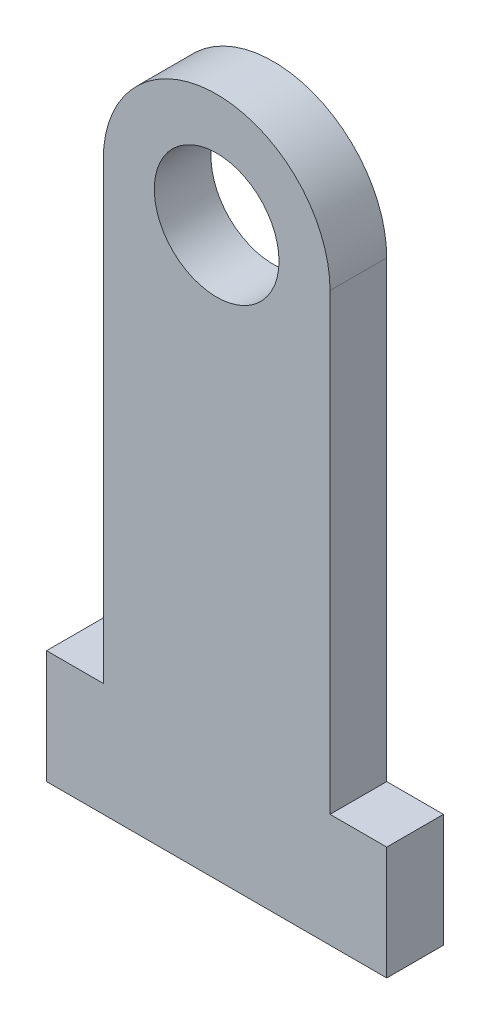
ISO-10303-21;
HEADER;
FILE_DESCRIPTION(('STEP AP214'),'2;1');
FILE_NAME('part.step','',(''),(''),'','','');
FILE_SCHEMA(('AUTOMOTIVE_DESIGN { 1 0 10303 214 1 1 1 1 }'));
ENDSEC;
DATA;
#1=APPLICATION_CONTEXT('core data for automotive mechanical design processes');
#2=APPLICATION_PROTOCOL_DEFINITION('international standard','automotive_design',2000,#1);
#3=PRODUCT_CONTEXT('',#1,'mechanical');
#4=PRODUCT('Part','Part','',(#3));
#5=PRODUCT_RELATED_PRODUCT_CATEGORY('part','',(#4));
#6=PRODUCT_DEFINITION_FORMATION('','',#4);
#7=PRODUCT_DEFINITION_CONTEXT('part definition',#1,'design');
#8=PRODUCT_DEFINITION('design','',#6,#7);
#9=PRODUCT_DEFINITION_SHAPE('','',#8);
#10=(LENGTH_UNIT() NAMED_UNIT(*) SI_UNIT(.MILLI.,.METRE.));
#11=(NAMED_UNIT(*) PLANE_ANGLE_UNIT() SI_UNIT($,.RADIAN.));
#12=(NAMED_UNIT(*) SI_UNIT($,.STERADIAN.) SOLID_ANGLE_UNIT());
#13=UNCERTAINTY_MEASURE_WITH_UNIT(LENGTH_MEASURE(1.E-05),#10,'distance_accuracy_value','');
#14=(GEOMETRIC_REPRESENTATION_CONTEXT(3) GLOBAL_UNCERTAINTY_ASSIGNED_CONTEXT((#13)) GLOBAL_UNIT_ASSIGNED_CONTEXT((#10,
#11,#12)) REPRESENTATION_CONTEXT('',''));
#15=CARTESIAN_POINT('',(0.,0.,0.));
#16=DIRECTION('',(0.,0.,1.));
#17=DIRECTION('',(1.,0.,0.));
#18=AXIS2_PLACEMENT_3D('',#15,#16,#17);
#19=CARTESIAN_POINT('',(50.,0.,10.));
#20=DIRECTION('',(-1.,0.,0.));
#21=DIRECTION('',(0.,-1.,0.));
#22=AXIS2_PLACEMENT_3D('',#19,#20,#21);
#23=PLANE('',#22);
#24=DIRECTION('',(0.,1.,0.));
#25=VECTOR('',#24,1.);
#26=CARTESIAN_POINT('',(50.,0.,0.));
#27=LINE('',#26,#25);
#28=CARTESIAN_POINT('',(50.,20.,0.));
#29=VERTEX_POINT('',#28);
#30=CARTESIAN_POINT('',(50.,100.,0.));
#31=VERTEX_POINT('',#30);
#32=EDGE_CURVE('E131',#29,#31,#27,.T.);
#33=ORIENTED_EDGE('',*,*,#32,.T.);
#34=DIRECTION('',(0.,0.,-1.));
#35=VECTOR('',#34,1.);
#36=CARTESIAN_POINT('',(50.,100.,10.));
#37=LINE('',#36,#35);
#38=CARTESIAN_POINT('',(50.,100.,10.));
#39=VERTEX_POINT('',#38);
#40=EDGE_CURVE('E11',#39,#31,#37,.T.);
#41=ORIENTED_EDGE('',*,*,#40,.F.);
#42=DIRECTION('',(0.,1.,0.));
#43=VECTOR('',#42,1.);
#44=CARTESIAN_POINT('',(50.,0.,10.));
#45=LINE('',#44,#43);
#46=CARTESIAN_POINT('',(50.,20.,10.));
#47=VERTEX_POINT('',#46);
#48=EDGE_CURVE('E152',#47,#39,#45,.T.);
#49=ORIENTED_EDGE('',*,*,#48,.F.);
#50=DIRECTION('',(0.,0.,-1.));
#51=VECTOR('',#50,1.);
#52=CARTESIAN_POINT('',(50.,20.,10.));
#53=LINE('',#52,#51);
#54=EDGE_CURVE('E51',#47,#29,#53,.T.);
#55=ORIENTED_EDGE('',*,*,#54,.T.);
#56=EDGE_LOOP('',(#33,#41,#49,#55));
#57=FACE_BOUND('',#56,.T.);
#58=ADVANCED_FACE('F35',(#57),#23,.F.);
#59=CARTESIAN_POINT('',(30.,100.,10.));
#60=DIRECTION('',(0.,0.,-1.));
#61=DIRECTION('',(-1.,0.,0.));
#62=AXIS2_PLACEMENT_3D('',#59,#60,#61);
#63=CYLINDRICAL_SURFACE('',#62,20.);
#64=CARTESIAN_POINT('',(30.,100.,0.));
#65=DIRECTION('',(0.,0.,1.));
#66=DIRECTION('',(1.,0.,0.));
#67=AXIS2_PLACEMENT_3D('',#64,#65,#66);
#68=CIRCLE('',#67,20.);
#69=CARTESIAN_POINT('',(10.,100.,0.));
#70=VERTEX_POINT('',#69);
#71=EDGE_CURVE('E133',#31,#70,#68,.T.);
#72=ORIENTED_EDGE('',*,*,#71,.T.);
#73=DIRECTION('',(0.,0.,-1.));
#74=VECTOR('',#73,1.);
#75=CARTESIAN_POINT('',(10.,100.,10.));
#76=LINE('',#75,#74);
#77=CARTESIAN_POINT('',(10.,100.,10.));
#78=VERTEX_POINT('',#77);
#79=EDGE_CURVE('E43',#78,#70,#76,.T.);
#80=ORIENTED_EDGE('',*,*,#79,.F.);
#81=CARTESIAN_POINT('',(30.,100.,10.));
#82=DIRECTION('',(0.,0.,1.));
#83=DIRECTION('',(1.,0.,0.));
#84=AXIS2_PLACEMENT_3D('',#81,#82,#83);
#85=CIRCLE('',#84,20.);
#86=EDGE_CURVE('E90',#39,#78,#85,.T.);
#87=ORIENTED_EDGE('',*,*,#86,.F.);
#88=ORIENTED_EDGE('',*,*,#40,.T.);
#89=EDGE_LOOP('',(#72,#80,#87,#88));
#90=FACE_BOUND('',#89,.T.);
#91=ADVANCED_FACE('F165',(#90),#63,.T.);
#92=CARTESIAN_POINT('',(10.,0.,10.));
#93=DIRECTION('',(-1.,0.,0.));
#94=DIRECTION('',(0.,0.,1.));
#95=AXIS2_PLACEMENT_3D('',#92,#93,#94);
#96=PLANE('',#95);
#97=DIRECTION('',(0.,1.,0.));
#98=VECTOR('',#97,1.);
#99=CARTESIAN_POINT('',(10.,0.,0.));
#100=LINE('',#99,#98);
#101=CARTESIAN_POINT('',(10.,20.,0.));
#102=VERTEX_POINT('',#101);
#103=EDGE_CURVE('E137',#102,#70,#100,.T.);
#104=ORIENTED_EDGE('',*,*,#103,.F.);
#105=DIRECTION('',(0.,0.,-1.));
#106=VECTOR('',#105,1.);
#107=CARTESIAN_POINT('',(10.,20.,10.));
#108=LINE('',#107,#106);
#109=CARTESIAN_POINT('',(10.,20.,10.));
#110=VERTEX_POINT('',#109);
#111=EDGE_CURVE('E158',#110,#102,#108,.T.);
#112=ORIENTED_EDGE('',*,*,#111,.F.);
#113=DIRECTION('',(0.,1.,0.));
#114=VECTOR('',#113,1.);
#115=CARTESIAN_POINT('',(10.,0.,10.));
#116=LINE('',#115,#114);
#117=EDGE_CURVE('E164',#110,#78,#116,.T.);
#118=ORIENTED_EDGE('',*,*,#117,.T.);
#119=ORIENTED_EDGE('',*,*,#79,.T.);
#120=EDGE_LOOP('',(#104,#112,#118,#119));
#121=FACE_BOUND('',#120,.T.);
#122=ADVANCED_FACE('F162',(#121),#96,.T.);
#123=CARTESIAN_POINT('',(0.,20.,10.));
#124=DIRECTION('',(0.,-1.,0.));
#125=DIRECTION('',(1.,0.,0.));
#126=AXIS2_PLACEMENT_3D('',#123,#124,#125);
#127=PLANE('',#126);
#128=DIRECTION('',(-1.,0.,0.));
#129=VECTOR('',#128,1.);
#130=CARTESIAN_POINT('',(0.,20.,0.));
#131=LINE('',#130,#129);
#132=CARTESIAN_POINT('',(0.,20.,0.));
#133=VERTEX_POINT('',#132);
#134=EDGE_CURVE('E140',#102,#133,#131,.T.);
#135=ORIENTED_EDGE('',*,*,#134,.T.);
#136=DIRECTION('',(0.,0.,-1.));
#137=VECTOR('',#136,1.);
#138=CARTESIAN_POINT('',(0.,20.,10.));
#139=LINE('',#138,#137);
#140=CARTESIAN_POINT('',(0.,20.,10.));
#141=VERTEX_POINT('',#140);
#142=EDGE_CURVE('E156',#141,#133,#139,.T.);
#143=ORIENTED_EDGE('',*,*,#142,.F.);
#144=DIRECTION('',(-1.,0.,0.));
#145=VECTOR('',#144,1.);
#146=CARTESIAN_POINT('',(0.,20.,10.));
#147=LINE('',#146,#145);
#148=EDGE_CURVE('E175',#110,#141,#147,.T.);
#149=ORIENTED_EDGE('',*,*,#148,.F.);
#150=ORIENTED_EDGE('',*,*,#111,.T.);
#151=EDGE_LOOP('',(#135,#143,#149,#150));
#152=FACE_BOUND('',#151,.T.);
#153=ADVANCED_FACE('F173',(#152),#127,.F.);
#154=CARTESIAN_POINT('',(0.,0.,10.));
#155=DIRECTION('',(-1.,0.,0.));
#156=DIRECTION('',(0.,0.,1.));
#157=AXIS2_PLACEMENT_3D('',#154,#155,#156);
#158=PLANE('',#157);
#159=DIRECTION('',(0.,1.,0.));
#160=VECTOR('',#159,1.);
#161=CARTESIAN_POINT('',(0.,0.,0.));
#162=LINE('',#161,#160);
#163=CARTESIAN_POINT('',(0.,0.,0.));
#164=VERTEX_POINT('',#163);
#165=EDGE_CURVE('E143',#164,#133,#162,.T.);
#166=ORIENTED_EDGE('',*,*,#165,.F.);
#167=DIRECTION('',(0.,0.,-1.));
#168=VECTOR('',#167,1.);
#169=CARTESIAN_POINT('',(0.,0.,10.));
#170=LINE('',#169,#168);
#171=CARTESIAN_POINT('',(0.,0.,10.));
#172=VERTEX_POINT('',#171);
#173=EDGE_CURVE('E123',#172,#164,#170,.T.);
#174=ORIENTED_EDGE('',*,*,#173,.F.);
#175=DIRECTION('',(0.,1.,0.));
#176=VECTOR('',#175,1.);
#177=CARTESIAN_POINT('',(0.,0.,10.));
#178=LINE('',#177,#176);
#179=EDGE_CURVE('E113',#172,#141,#178,.T.);
#180=ORIENTED_EDGE('',*,*,#179,.T.);
#181=ORIENTED_EDGE('',*,*,#142,.T.);
#182=EDGE_LOOP('',(#166,#174,#180,#181));
#183=FACE_BOUND('',#182,.T.);
#184=ADVANCED_FACE('F181',(#183),#158,.T.);
#185=CARTESIAN_POINT('',(0.,0.,10.));
#186=DIRECTION('',(0.,1.,0.));
#187=DIRECTION('',(0.,0.,1.));
#188=AXIS2_PLACEMENT_3D('',#185,#186,#187);
#189=PLANE('',#188);
#190=DIRECTION('',(1.,0.,0.));
#191=VECTOR('',#190,1.);
#192=CARTESIAN_POINT('',(0.,0.,0.));
#193=LINE('',#192,#191);
#194=CARTESIAN_POINT('',(60.,0.,0.));
#195=VERTEX_POINT('',#194);
#196=EDGE_CURVE('E120',#164,#195,#193,.T.);
#197=ORIENTED_EDGE('',*,*,#196,.T.);
#198=DIRECTION('',(0.,0.,-1.));
#199=VECTOR('',#198,1.);
#200=CARTESIAN_POINT('',(60.,0.,10.));
#201=LINE('',#200,#199);
#202=CARTESIAN_POINT('',(60.,0.,10.));
#203=VERTEX_POINT('',#202);
#204=EDGE_CURVE('E117',#203,#195,#201,.T.);
#205=ORIENTED_EDGE('',*,*,#204,.F.);
#206=DIRECTION('',(1.,0.,0.));
#207=VECTOR('',#206,1.);
#208=CARTESIAN_POINT('',(0.,0.,10.));
#209=LINE('',#208,#207);
#210=EDGE_CURVE('E106',#172,#203,#209,.T.);
#211=ORIENTED_EDGE('',*,*,#210,.F.);
#212=ORIENTED_EDGE('',*,*,#173,.T.);
#213=EDGE_LOOP('',(#197,#205,#211,#212));
#214=FACE_BOUND('',#213,.T.);
#215=ADVANCED_FACE('F118',(#214),#189,.F.);
#216=CARTESIAN_POINT('',(60.,0.,10.));
#217=DIRECTION('',(-1.,0.,0.));
#218=DIRECTION('',(0.,-1.,0.));
#219=AXIS2_PLACEMENT_3D('',#216,#217,#218);
#220=PLANE('',#219);
#221=DIRECTION('',(0.,1.,0.));
#222=VECTOR('',#221,1.);
#223=CARTESIAN_POINT('',(60.,0.,0.));
#224=LINE('',#223,#222);
#225=CARTESIAN_POINT('',(60.,20.,0.));
#226=VERTEX_POINT('',#225);
#227=EDGE_CURVE('E147',#195,#226,#224,.T.);
#228=ORIENTED_EDGE('',*,*,#227,.T.);
#229=DIRECTION('',(0.,0.,-1.));
#230=VECTOR('',#229,1.);
#231=CARTESIAN_POINT('',(60.,20.,10.));
#232=LINE('',#231,#230);
#233=CARTESIAN_POINT('',(60.,20.,10.));
#234=VERTEX_POINT('',#233);
#235=EDGE_CURVE('E78',#234,#226,#232,.T.);
#236=ORIENTED_EDGE('',*,*,#235,.F.);
#237=DIRECTION('',(0.,1.,0.));
#238=VECTOR('',#237,1.);
#239=CARTESIAN_POINT('',(60.,0.,10.));
#240=LINE('',#239,#238);
#241=EDGE_CURVE('E111',#203,#234,#240,.T.);
#242=ORIENTED_EDGE('',*,*,#241,.F.);
#243=ORIENTED_EDGE('',*,*,#204,.T.);
#244=EDGE_LOOP('',(#228,#236,#242,#243));
#245=FACE_BOUND('',#244,.T.);
#246=ADVANCED_FACE('F125',(#245),#220,.F.);
#247=CARTESIAN_POINT('',(0.,19.9999999999999,10.));
#248=DIRECTION('',(0.,1.,0.));
#249=DIRECTION('',(-1.,0.,0.));
#250=AXIS2_PLACEMENT_3D('',#247,#248,#249);
#251=PLANE('',#250);
#252=DIRECTION('',(1.,0.,0.));
#253=VECTOR('',#252,1.);
#254=CARTESIAN_POINT('',(0.,19.9999999999999,0.));
#255=LINE('',#254,#253);
#256=EDGE_CURVE('E149',#29,#226,#255,.T.);
#257=ORIENTED_EDGE('',*,*,#256,.F.);
#258=ORIENTED_EDGE('',*,*,#54,.F.);
#259=DIRECTION('',(1.,0.,0.));
#260=VECTOR('',#259,1.);
#261=CARTESIAN_POINT('',(0.,19.9999999999999,10.));
#262=LINE('',#261,#260);
#263=EDGE_CURVE('E126',#47,#234,#262,.T.);
#264=ORIENTED_EDGE('',*,*,#263,.T.);
#265=ORIENTED_EDGE('',*,*,#235,.T.);
#266=EDGE_LOOP('',(#257,#258,#264,#265));
#267=FACE_BOUND('',#266,.T.);
#268=ADVANCED_FACE('F182',(#267),#251,.T.);
#269=CARTESIAN_POINT('',(0.,0.,10.));
#270=DIRECTION('',(0.,0.,1.));
#271=DIRECTION('',(1.,0.,0.));
#272=AXIS2_PLACEMENT_3D('',#269,#270,#271);
#273=PLANE('',#272);
#274=CARTESIAN_POINT('',(30.,100.,10.));
#275=DIRECTION('',(0.,0.,1.));
#276=DIRECTION('',(1.,0.,0.));
#277=AXIS2_PLACEMENT_3D('',#274,#275,#276);
#278=CIRCLE('',#277,11.);
#279=CARTESIAN_POINT('',(41.,100.,10.));
#280=VERTEX_POINT('',#279);
#281=EDGE_CURVE('E198',#280,#280,#278,.T.);
#282=ORIENTED_EDGE('',*,*,#281,.F.);
#283=EDGE_LOOP('',(#282));
#284=FACE_BOUND('',#283,.T.);
#285=ORIENTED_EDGE('',*,*,#48,.T.);
#286=ORIENTED_EDGE('',*,*,#86,.T.);
#287=ORIENTED_EDGE('',*,*,#117,.F.);
#288=ORIENTED_EDGE('',*,*,#148,.T.);
#289=ORIENTED_EDGE('',*,*,#179,.F.);
#290=ORIENTED_EDGE('',*,*,#210,.T.);
#291=ORIENTED_EDGE('',*,*,#241,.T.);
#292=ORIENTED_EDGE('',*,*,#263,.F.);
#293=EDGE_LOOP('',(#285,#286,#287,#288,#289,#290,#291,#292));
#294=FACE_BOUND('',#293,.T.);
#295=ADVANCED_FACE('F108',(#284,#294),#273,.T.);
#296=CARTESIAN_POINT('',(0.,0.,0.));
#297=DIRECTION('',(0.,0.,1.));
#298=DIRECTION('',(1.,0.,0.));
#299=AXIS2_PLACEMENT_3D('',#296,#297,#298);
#300=PLANE('',#299);
#301=CARTESIAN_POINT('',(30.,100.,0.));
#302=DIRECTION('',(0.,0.,1.));
#303=DIRECTION('',(1.,0.,0.));
#304=AXIS2_PLACEMENT_3D('',#301,#302,#303);
#305=CIRCLE('',#304,11.);
#306=CARTESIAN_POINT('',(41.,100.,0.));
#307=VERTEX_POINT('',#306);
#308=EDGE_CURVE('E134',#307,#307,#305,.T.);
#309=ORIENTED_EDGE('',*,*,#308,.T.);
#310=EDGE_LOOP('',(#309));
#311=FACE_BOUND('',#310,.T.);
#312=ORIENTED_EDGE('',*,*,#32,.F.);
#313=ORIENTED_EDGE('',*,*,#256,.T.);
#314=ORIENTED_EDGE('',*,*,#227,.F.);
#315=ORIENTED_EDGE('',*,*,#196,.F.);
#316=ORIENTED_EDGE('',*,*,#165,.T.);
#317=ORIENTED_EDGE('',*,*,#134,.F.);
#318=ORIENTED_EDGE('',*,*,#103,.T.);
#319=ORIENTED_EDGE('',*,*,#71,.F.);
#320=EDGE_LOOP('',(#312,#313,#314,#315,#316,#317,#318,#319));
#321=FACE_BOUND('',#320,.T.);
#322=ADVANCED_FACE('F169',(#311,#321),#300,.F.);
#323=CARTESIAN_POINT('',(30.,100.,0.));
#324=DIRECTION('',(0.,0.,1.));
#325=DIRECTION('',(1.,0.,0.));
#326=AXIS2_PLACEMENT_3D('',#323,#324,#325);
#327=CYLINDRICAL_SURFACE('',#326,11.);
#328=ORIENTED_EDGE('',*,*,#308,.F.);
#329=EDGE_LOOP('',(#328));
#330=FACE_BOUND('',#329,.T.);
#331=ORIENTED_EDGE('',*,*,#281,.T.);
#332=EDGE_LOOP('',(#331));
#333=FACE_BOUND('',#332,.T.);
#334=ADVANCED_FACE('F205',(#330,#333),#327,.F.);
#335=CLOSED_SHELL('',(#58,#91,#122,#153,#184,#215,#246,#268,#295,#322,#334));
#336=MANIFOLD_SOLID_BREP('B2',#335);
#337=ADVANCED_BREP_SHAPE_REPRESENTATION('',(#18,#336),#14);
#338=SHAPE_DEFINITION_REPRESENTATION(#9,#337);
ENDSEC;
END-ISO-10303-21;
